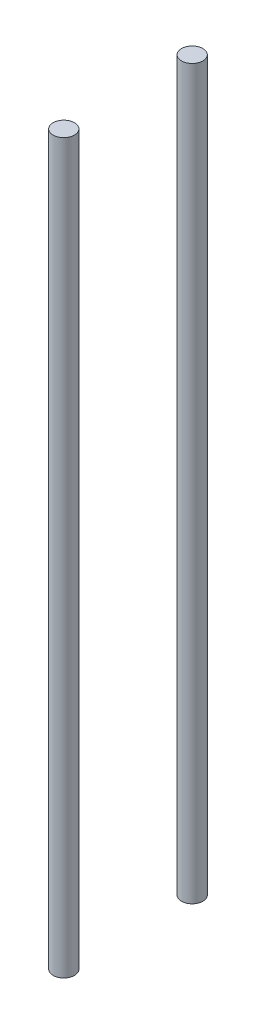
ISO-10303-21;
HEADER;
FILE_DESCRIPTION(('STEP AP214'),'2;1');
FILE_NAME('part.step','',(''),(''),'','','');
FILE_SCHEMA(('AUTOMOTIVE_DESIGN { 1 0 10303 214 1 1 1 1 }'));
ENDSEC;
DATA;
#1=APPLICATION_CONTEXT('core data for automotive mechanical design processes');
#2=APPLICATION_PROTOCOL_DEFINITION('international standard','automotive_design',2000,#1);
#3=PRODUCT_CONTEXT('',#1,'mechanical');
#4=PRODUCT('Part','Part','',(#3));
#5=PRODUCT_RELATED_PRODUCT_CATEGORY('part','',(#4));
#6=PRODUCT_DEFINITION_FORMATION('','',#4);
#7=PRODUCT_DEFINITION_CONTEXT('part definition',#1,'design');
#8=PRODUCT_DEFINITION('design','',#6,#7);
#9=PRODUCT_DEFINITION_SHAPE('','',#8);
#10=(LENGTH_UNIT() NAMED_UNIT(*) SI_UNIT(.MILLI.,.METRE.));
#11=(NAMED_UNIT(*) PLANE_ANGLE_UNIT() SI_UNIT($,.RADIAN.));
#12=(NAMED_UNIT(*) SI_UNIT($,.STERADIAN.) SOLID_ANGLE_UNIT());
#13=UNCERTAINTY_MEASURE_WITH_UNIT(LENGTH_MEASURE(1.E-05),#10,'distance_accuracy_value','');
#14=(GEOMETRIC_REPRESENTATION_CONTEXT(3) GLOBAL_UNCERTAINTY_ASSIGNED_CONTEXT((#13)) GLOBAL_UNIT_ASSIGNED_CONTEXT((#10,
#11,#12)) REPRESENTATION_CONTEXT('',''));
#15=CARTESIAN_POINT('',(0.,0.,0.));
#16=DIRECTION('',(0.,0.,1.));
#17=DIRECTION('',(1.,0.,0.));
#18=AXIS2_PLACEMENT_3D('',#15,#16,#17);
#19=CARTESIAN_POINT('',(0.,17.,-1.5));
#20=DIRECTION('',(0.,-1.,0.));
#21=DIRECTION('',(0.,0.,-1.));
#22=AXIS2_PLACEMENT_3D('',#19,#20,#21);
#23=CYLINDRICAL_SURFACE('',#22,0.25);
#24=CARTESIAN_POINT('',(0.,17.,-1.5));
#25=DIRECTION('',(0.,1.,0.));
#26=DIRECTION('',(0.,0.,1.));
#27=AXIS2_PLACEMENT_3D('',#24,#25,#26);
#28=CIRCLE('',#27,0.25);
#29=CARTESIAN_POINT('',(0.,17.,-1.25));
#30=VERTEX_POINT('',#29);
#31=EDGE_CURVE('E11',#30,#30,#28,.T.);
#32=ORIENTED_EDGE('',*,*,#31,.F.);
#33=EDGE_LOOP('',(#32));
#34=FACE_BOUND('',#33,.T.);
#35=CARTESIAN_POINT('',(0.,0.,-1.5));
#36=DIRECTION('',(0.,1.,0.));
#37=DIRECTION('',(0.,0.,1.));
#38=AXIS2_PLACEMENT_3D('',#35,#36,#37);
#39=CIRCLE('',#38,0.25);
#40=CARTESIAN_POINT('',(0.,0.,-1.25));
#41=VERTEX_POINT('',#40);
#42=EDGE_CURVE('E43',#41,#41,#39,.T.);
#43=ORIENTED_EDGE('',*,*,#42,.T.);
#44=EDGE_LOOP('',(#43));
#45=FACE_BOUND('',#44,.T.);
#46=ADVANCED_FACE('F40',(#34,#45),#23,.T.);
#47=CARTESIAN_POINT('',(0.,17.,-1.5));
#48=DIRECTION('',(0.,1.,0.));
#49=DIRECTION('',(0.,0.,1.));
#50=AXIS2_PLACEMENT_3D('',#47,#48,#49);
#51=PLANE('',#50);
#52=ORIENTED_EDGE('',*,*,#31,.T.);
#53=EDGE_LOOP('',(#52));
#54=FACE_BOUND('',#53,.T.);
#55=ADVANCED_FACE('F55',(#54),#51,.T.);
#56=CARTESIAN_POINT('',(0.,0.,-1.5));
#57=DIRECTION('',(0.,1.,0.));
#58=DIRECTION('',(0.,0.,1.));
#59=AXIS2_PLACEMENT_3D('',#56,#57,#58);
#60=PLANE('',#59);
#61=ORIENTED_EDGE('',*,*,#42,.F.);
#62=EDGE_LOOP('',(#61));
#63=FACE_BOUND('',#62,.T.);
#64=ADVANCED_FACE('F53',(#63),#60,.F.);
#65=CLOSED_SHELL('',(#46,#55,#64));
#66=MANIFOLD_SOLID_BREP('B2',#65);
#67=CARTESIAN_POINT('',(0.,17.,1.5));
#68=DIRECTION('',(0.,-1.,0.));
#69=DIRECTION('',(0.,0.,-1.));
#70=AXIS2_PLACEMENT_3D('',#67,#68,#69);
#71=CYLINDRICAL_SURFACE('',#70,0.25);
#72=CARTESIAN_POINT('',(0.,17.,1.5));
#73=DIRECTION('',(0.,1.,0.));
#74=DIRECTION('',(0.,0.,1.));
#75=AXIS2_PLACEMENT_3D('',#72,#73,#74);
#76=CIRCLE('',#75,0.25);
#77=CARTESIAN_POINT('',(0.,17.,1.75));
#78=VERTEX_POINT('',#77);
#79=EDGE_CURVE('E39',#78,#78,#76,.T.);
#80=ORIENTED_EDGE('',*,*,#79,.F.);
#81=EDGE_LOOP('',(#80));
#82=FACE_BOUND('',#81,.T.);
#83=CARTESIAN_POINT('',(0.,0.,1.5));
#84=DIRECTION('',(0.,1.,0.));
#85=DIRECTION('',(0.,0.,1.));
#86=AXIS2_PLACEMENT_3D('',#83,#84,#85);
#87=CIRCLE('',#86,0.25);
#88=CARTESIAN_POINT('',(0.,0.,1.75));
#89=VERTEX_POINT('',#88);
#90=EDGE_CURVE('E85',#89,#89,#87,.T.);
#91=ORIENTED_EDGE('',*,*,#90,.T.);
#92=EDGE_LOOP('',(#91));
#93=FACE_BOUND('',#92,.T.);
#94=ADVANCED_FACE('F82',(#82,#93),#71,.T.);
#95=CARTESIAN_POINT('',(0.,17.,1.5));
#96=DIRECTION('',(0.,1.,0.));
#97=DIRECTION('',(0.,0.,1.));
#98=AXIS2_PLACEMENT_3D('',#95,#96,#97);
#99=PLANE('',#98);
#100=ORIENTED_EDGE('',*,*,#79,.T.);
#101=EDGE_LOOP('',(#100));
#102=FACE_BOUND('',#101,.T.);
#103=ADVANCED_FACE('F97',(#102),#99,.T.);
#104=CARTESIAN_POINT('',(0.,0.,1.5));
#105=DIRECTION('',(0.,1.,0.));
#106=DIRECTION('',(0.,0.,1.));
#107=AXIS2_PLACEMENT_3D('',#104,#105,#106);
#108=PLANE('',#107);
#109=ORIENTED_EDGE('',*,*,#90,.F.);
#110=EDGE_LOOP('',(#109));
#111=FACE_BOUND('',#110,.T.);
#112=ADVANCED_FACE('F95',(#111),#108,.F.);
#113=CLOSED_SHELL('',(#94,#103,#112));
#114=MANIFOLD_SOLID_BREP('B6',#113);
#115=ADVANCED_BREP_SHAPE_REPRESENTATION('',(#18,#66,#114),#14);
#116=SHAPE_DEFINITION_REPRESENTATION(#9,#115);
ENDSEC;
END-ISO-10303-21;
